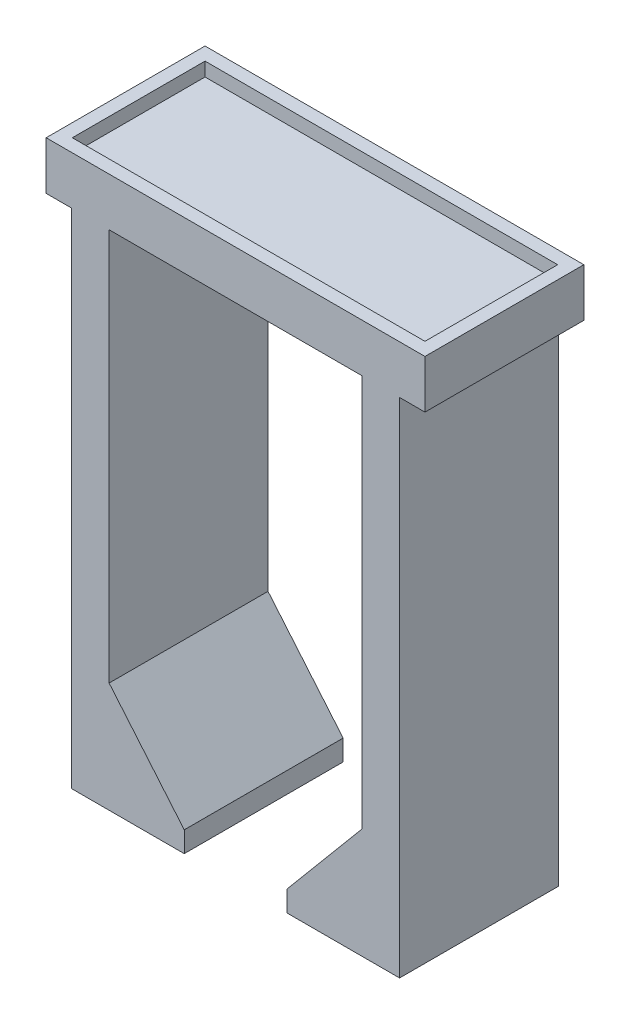
ISO-10303-21;
HEADER;
FILE_DESCRIPTION(('STEP AP214'),'2;1');
FILE_NAME('part.step','',(''),(''),'','','');
FILE_SCHEMA(('AUTOMOTIVE_DESIGN { 1 0 10303 214 1 1 1 1 }'));
ENDSEC;
DATA;
#1=APPLICATION_CONTEXT('core data for automotive mechanical design processes');
#2=APPLICATION_PROTOCOL_DEFINITION('international standard','automotive_design',2000,#1);
#3=PRODUCT_CONTEXT('',#1,'mechanical');
#4=PRODUCT('Part','Part','',(#3));
#5=PRODUCT_RELATED_PRODUCT_CATEGORY('part','',(#4));
#6=PRODUCT_DEFINITION_FORMATION('','',#4);
#7=PRODUCT_DEFINITION_CONTEXT('part definition',#1,'design');
#8=PRODUCT_DEFINITION('design','',#6,#7);
#9=PRODUCT_DEFINITION_SHAPE('','',#8);
#10=(LENGTH_UNIT() NAMED_UNIT(*) SI_UNIT(.MILLI.,.METRE.));
#11=(NAMED_UNIT(*) PLANE_ANGLE_UNIT() SI_UNIT($,.RADIAN.));
#12=(NAMED_UNIT(*) SI_UNIT($,.STERADIAN.) SOLID_ANGLE_UNIT());
#13=UNCERTAINTY_MEASURE_WITH_UNIT(LENGTH_MEASURE(1.E-05),#10,'distance_accuracy_value','');
#14=(GEOMETRIC_REPRESENTATION_CONTEXT(3) GLOBAL_UNCERTAINTY_ASSIGNED_CONTEXT((#13)) GLOBAL_UNIT_ASSIGNED_CONTEXT((#10,
#11,#12)) REPRESENTATION_CONTEXT('',''));
#15=CARTESIAN_POINT('',(0.,0.,0.));
#16=DIRECTION('',(0.,0.,1.));
#17=DIRECTION('',(1.,0.,0.));
#18=AXIS2_PLACEMENT_3D('',#15,#16,#17);
#19=CARTESIAN_POINT('',(0.,25.,0.));
#20=DIRECTION('',(0.,1.,0.));
#21=DIRECTION('',(0.,0.,1.));
#22=AXIS2_PLACEMENT_3D('',#19,#20,#21);
#23=PLANE('',#22);
#24=DIRECTION('',(-1.,0.,0.));
#25=VECTOR('',#24,1.);
#26=CARTESIAN_POINT('',(27.4999999999999,25.,-11.5350000000002));
#27=LINE('',#26,#25);
#28=CARTESIAN_POINT('',(-23.8159981116584,25.,-11.5349999999996));
#29=VERTEX_POINT('',#28);
#30=CARTESIAN_POINT('',(-27.5000000000001,25.,-11.5349999999998));
#31=VERTEX_POINT('',#30);
#32=EDGE_CURVE('E321',#29,#31,#27,.T.);
#33=ORIENTED_EDGE('',*,*,#32,.F.);
#34=DIRECTION('',(0.,0.,1.));
#35=VECTOR('',#34,1.);
#36=CARTESIAN_POINT('',(-23.815998111658,25.,11.5350000000002));
#37=LINE('',#36,#35);
#38=CARTESIAN_POINT('',(-23.815998111658,25.,11.5350000000002));
#39=VERTEX_POINT('',#38);
#40=EDGE_CURVE('E189',#29,#39,#37,.T.);
#41=ORIENTED_EDGE('',*,*,#40,.T.);
#42=DIRECTION('',(1.,0.,0.));
#43=VECTOR('',#42,1.);
#44=CARTESIAN_POINT('',(-27.4999999999999,25.,11.5350000000002));
#45=LINE('',#44,#43);
#46=CARTESIAN_POINT('',(-27.4999999999999,25.,11.5350000000002));
#47=VERTEX_POINT('',#46);
#48=EDGE_CURVE('E325',#47,#39,#45,.T.);
#49=ORIENTED_EDGE('',*,*,#48,.F.);
#50=DIRECTION('',(0.,0.,1.));
#51=VECTOR('',#50,1.);
#52=CARTESIAN_POINT('',(-27.5000000000001,25.,-11.5349999999998));
#53=LINE('',#52,#51);
#54=EDGE_CURVE('E315',#31,#47,#53,.T.);
#55=ORIENTED_EDGE('',*,*,#54,.F.);
#56=EDGE_LOOP('',(#33,#41,#49,#55));
#57=FACE_BOUND('',#56,.T.);
#58=ADVANCED_FACE('F35',(#57),#23,.F.);
#59=DIRECTION('',(0.,0.,1.));
#60=VECTOR('',#59,1.);
#61=CARTESIAN_POINT('',(23.8159981116582,25.,11.5349999999998));
#62=LINE('',#61,#60);
#63=CARTESIAN_POINT('',(23.8159981116582,25.,-11.5350000000002));
#64=VERTEX_POINT('',#63);
#65=CARTESIAN_POINT('',(23.8159981116582,25.,11.5349999999998));
#66=VERTEX_POINT('',#65);
#67=EDGE_CURVE('E254',#64,#66,#62,.T.);
#68=ORIENTED_EDGE('',*,*,#67,.F.);
#69=CARTESIAN_POINT('',(27.4999999999999,25.,-11.5350000000002));
#70=VERTEX_POINT('',#69);
#71=EDGE_CURVE('E316',#70,#64,#27,.T.);
#72=ORIENTED_EDGE('',*,*,#71,.F.);
#73=DIRECTION('',(0.,0.,-1.));
#74=VECTOR('',#73,1.);
#75=CARTESIAN_POINT('',(27.5000000000001,25.,11.5349999999998));
#76=LINE('',#75,#74);
#77=CARTESIAN_POINT('',(27.5000000000001,25.,11.5349999999998));
#78=VERTEX_POINT('',#77);
#79=EDGE_CURVE('E312',#78,#70,#76,.T.);
#80=ORIENTED_EDGE('',*,*,#79,.F.);
#81=EDGE_CURVE('E319',#66,#78,#45,.T.);
#82=ORIENTED_EDGE('',*,*,#81,.F.);
#83=EDGE_LOOP('',(#68,#72,#80,#82));
#84=FACE_BOUND('',#83,.T.);
#85=ADVANCED_FACE('F380',(#84),#23,.F.);
#86=CARTESIAN_POINT('',(-18.3582173931283,25.,11.5350000000001));
#87=VERTEX_POINT('',#86);
#88=CARTESIAN_POINT('',(18.3582173931285,25.,11.5349999999998));
#89=VERTEX_POINT('',#88);
#90=EDGE_CURVE('E329',#87,#89,#45,.T.);
#91=ORIENTED_EDGE('',*,*,#90,.F.);
#92=DIRECTION('',(0.,0.,-1.));
#93=VECTOR('',#92,1.);
#94=CARTESIAN_POINT('',(-18.3582173931287,25.,-11.5349999999999));
#95=LINE('',#94,#93);
#96=CARTESIAN_POINT('',(-18.3582173931287,25.,-11.5349999999999));
#97=VERTEX_POINT('',#96);
#98=EDGE_CURVE('E224',#87,#97,#95,.T.);
#99=ORIENTED_EDGE('',*,*,#98,.T.);
#100=CARTESIAN_POINT('',(18.3582173931285,25.,-11.5350000000002));
#101=VERTEX_POINT('',#100);
#102=EDGE_CURVE('E320',#101,#97,#27,.T.);
#103=ORIENTED_EDGE('',*,*,#102,.F.);
#104=DIRECTION('',(0.,0.,-1.));
#105=VECTOR('',#104,1.);
#106=CARTESIAN_POINT('',(18.3582173931285,25.,-11.5350000000002));
#107=LINE('',#106,#105);
#108=EDGE_CURVE('E257',#89,#101,#107,.T.);
#109=ORIENTED_EDGE('',*,*,#108,.F.);
#110=EDGE_LOOP('',(#91,#99,#103,#109));
#111=FACE_BOUND('',#110,.T.);
#112=ADVANCED_FACE('F407',(#111),#23,.F.);
#113=CARTESIAN_POINT('',(27.5000000000001,30.,11.5349999999998));
#114=DIRECTION('',(-1.,0.,0.));
#115=DIRECTION('',(0.,0.,1.));
#116=AXIS2_PLACEMENT_3D('',#113,#114,#115);
#117=PLANE('',#116);
#118=ORIENTED_EDGE('',*,*,#79,.T.);
#119=DIRECTION('',(0.,-1.,0.));
#120=VECTOR('',#119,1.);
#121=CARTESIAN_POINT('',(27.4999999999999,30.,-11.5350000000002));
#122=LINE('',#121,#120);
#123=CARTESIAN_POINT('',(27.4999999999999,32.,-11.5350000000002));
#124=VERTEX_POINT('',#123);
#125=EDGE_CURVE('E338',#124,#70,#122,.T.);
#126=ORIENTED_EDGE('',*,*,#125,.F.);
#127=DIRECTION('',(0.,0.,-1.));
#128=VECTOR('',#127,1.);
#129=CARTESIAN_POINT('',(27.5,32.,-2.27461574114861E-13));
#130=LINE('',#129,#128);
#131=CARTESIAN_POINT('',(27.5000000000001,32.,11.5349999999998));
#132=VERTEX_POINT('',#131);
#133=EDGE_CURVE('E275',#132,#124,#130,.T.);
#134=ORIENTED_EDGE('',*,*,#133,.F.);
#135=DIRECTION('',(0.,-1.,0.));
#136=VECTOR('',#135,1.);
#137=CARTESIAN_POINT('',(27.5000000000001,30.,11.5349999999998));
#138=LINE('',#137,#136);
#139=EDGE_CURVE('E324',#132,#78,#138,.T.);
#140=ORIENTED_EDGE('',*,*,#139,.T.);
#141=EDGE_LOOP('',(#118,#126,#134,#140));
#142=FACE_BOUND('',#141,.T.);
#143=ADVANCED_FACE('F378',(#142),#117,.F.);
#144=CARTESIAN_POINT('',(27.4999999999999,30.,-11.5350000000002));
#145=DIRECTION('',(0.,0.,1.));
#146=DIRECTION('',(1.,0.,0.));
#147=AXIS2_PLACEMENT_3D('',#144,#145,#146);
#148=PLANE('',#147);
#149=ORIENTED_EDGE('',*,*,#125,.T.);
#150=ORIENTED_EDGE('',*,*,#71,.T.);
#151=DIRECTION('',(0.,1.,0.));
#152=VECTOR('',#151,1.);
#153=CARTESIAN_POINT('',(23.8159981116582,-45.,-11.535));
#154=LINE('',#153,#152);
#155=CARTESIAN_POINT('',(23.8159981116582,-48.,-11.5350000000002));
#156=VERTEX_POINT('',#155);
#157=EDGE_CURVE('E260',#156,#64,#154,.T.);
#158=ORIENTED_EDGE('',*,*,#157,.F.);
#159=DIRECTION('',(1.,0.,0.));
#160=VECTOR('',#159,1.);
#161=CARTESIAN_POINT('',(23.8159981116582,-48.,-11.5350000000002));
#162=LINE('',#161,#160);
#163=CARTESIAN_POINT('',(7.44747380165818,-48.,-11.5350000000002));
#164=VERTEX_POINT('',#163);
#165=EDGE_CURVE('E240',#164,#156,#162,.T.);
#166=ORIENTED_EDGE('',*,*,#165,.F.);
#167=DIRECTION('',(0.,1.,0.));
#168=VECTOR('',#167,1.);
#169=CARTESIAN_POINT('',(7.44747380165818,-48.,-11.5350000000002));
#170=LINE('',#169,#168);
#171=CARTESIAN_POINT('',(7.44747380165818,-45.,-11.5350000000002));
#172=VERTEX_POINT('',#171);
#173=EDGE_CURVE('E243',#164,#172,#170,.T.);
#174=ORIENTED_EDGE('',*,*,#173,.T.);
#175=DIRECTION('',(1.,0.,0.));
#176=VECTOR('',#175,1.);
#177=CARTESIAN_POINT('',(23.8159981116582,-45.,-11.5350000000002));
#178=LINE('',#177,#176);
#179=CARTESIAN_POINT('',(7.44992218782377,-45.,-11.5350000000002));
#180=VERTEX_POINT('',#179);
#181=EDGE_CURVE('E236',#172,#180,#178,.T.);
#182=ORIENTED_EDGE('',*,*,#181,.T.);
#183=DIRECTION('',(0.642787609686543,0.766044443118975,0.));
#184=VECTOR('',#183,1.);
#185=CARTESIAN_POINT('',(52.6644220947875,8.88454270147408,-11.5350000000004));
#186=LINE('',#185,#184);
#187=CARTESIAN_POINT('',(18.3582173931285,-32.,-11.5350000000002));
#188=VERTEX_POINT('',#187);
#189=EDGE_CURVE('E344',#180,#188,#186,.T.);
#190=ORIENTED_EDGE('',*,*,#189,.T.);
#191=DIRECTION('',(0.,1.,0.));
#192=VECTOR('',#191,1.);
#193=CARTESIAN_POINT('',(18.3582173931285,-45.,-11.5350000000002));
#194=LINE('',#193,#192);
#195=EDGE_CURVE('E263',#188,#101,#194,.T.);
#196=ORIENTED_EDGE('',*,*,#195,.T.);
#197=ORIENTED_EDGE('',*,*,#102,.T.);
#198=DIRECTION('',(0.,1.,0.));
#199=VECTOR('',#198,1.);
#200=CARTESIAN_POINT('',(-18.3582173931287,-45.,-11.5349999999999));
#201=LINE('',#200,#199);
#202=CARTESIAN_POINT('',(-18.3582173931287,-32.0000000000001,-11.5349999999999));
#203=VERTEX_POINT('',#202);
#204=EDGE_CURVE('E193',#203,#97,#201,.T.);
#205=ORIENTED_EDGE('',*,*,#204,.F.);
#206=DIRECTION('',(-0.642787609686543,0.766044443118975,0.));
#207=VECTOR('',#206,1.);
#208=CARTESIAN_POINT('',(-29.939746980628,-18.1976705063617,-11.5349999999997));
#209=LINE('',#208,#207);
#210=CARTESIAN_POINT('',(-7.44992218782397,-45.,-11.5350000000001));
#211=VERTEX_POINT('',#210);
#212=EDGE_CURVE('E43',#203,#211,#209,.F.);
#213=ORIENTED_EDGE('',*,*,#212,.T.);
#214=DIRECTION('',(-1.,0.,0.));
#215=VECTOR('',#214,1.);
#216=CARTESIAN_POINT('',(-23.8159981116584,-45.,-11.5349999999998));
#217=LINE('',#216,#215);
#218=CARTESIAN_POINT('',(-7.44747380165837,-45.,-11.5350000000001));
#219=VERTEX_POINT('',#218);
#220=EDGE_CURVE('E214',#219,#211,#217,.T.);
#221=ORIENTED_EDGE('',*,*,#220,.F.);
#222=DIRECTION('',(0.,1.,0.));
#223=VECTOR('',#222,1.);
#224=CARTESIAN_POINT('',(-7.44747380165837,-48.,-11.5350000000001));
#225=LINE('',#224,#223);
#226=CARTESIAN_POINT('',(-7.44747380165837,-48.,-11.5350000000001));
#227=VERTEX_POINT('',#226);
#228=EDGE_CURVE('E207',#227,#219,#225,.T.);
#229=ORIENTED_EDGE('',*,*,#228,.F.);
#230=DIRECTION('',(-1.,0.,0.));
#231=VECTOR('',#230,1.);
#232=CARTESIAN_POINT('',(-23.8159981116584,-48.,-11.5349999999998));
#233=LINE('',#232,#231);
#234=CARTESIAN_POINT('',(-23.8159981116584,-48.,-11.5349999999998));
#235=VERTEX_POINT('',#234);
#236=EDGE_CURVE('E199',#227,#235,#233,.T.);
#237=ORIENTED_EDGE('',*,*,#236,.T.);
#238=DIRECTION('',(0.,1.,0.));
#239=VECTOR('',#238,1.);
#240=CARTESIAN_POINT('',(-23.8159981116584,-45.,-11.5349999999996));
#241=LINE('',#240,#239);
#242=EDGE_CURVE('E183',#235,#29,#241,.T.);
#243=ORIENTED_EDGE('',*,*,#242,.T.);
#244=ORIENTED_EDGE('',*,*,#32,.T.);
#245=DIRECTION('',(0.,-1.,0.));
#246=VECTOR('',#245,1.);
#247=CARTESIAN_POINT('',(-27.5000000000001,30.,-11.5349999999998));
#248=LINE('',#247,#246);
#249=CARTESIAN_POINT('',(-27.5000000000001,32.,-11.5349999999998));
#250=VERTEX_POINT('',#249);
#251=EDGE_CURVE('E335',#250,#31,#248,.T.);
#252=ORIENTED_EDGE('',*,*,#251,.F.);
#253=DIRECTION('',(-1.,0.,0.));
#254=VECTOR('',#253,1.);
#255=CARTESIAN_POINT('',(0.,32.,-11.535));
#256=LINE('',#255,#254);
#257=EDGE_CURVE('E279',#124,#250,#256,.T.);
#258=ORIENTED_EDGE('',*,*,#257,.F.);
#259=EDGE_LOOP('',(#149,#150,#158,#166,#174,#182,#190,#196,#197,#205,#213,#221,#229,#237,#243,
#244,#252,#258));
#260=FACE_BOUND('',#259,.T.);
#261=ADVANCED_FACE('F206',(#260),#148,.F.);
#262=CARTESIAN_POINT('',(-27.5000000000001,30.,-11.5349999999998));
#263=DIRECTION('',(1.,0.,0.));
#264=DIRECTION('',(0.,0.,-1.));
#265=AXIS2_PLACEMENT_3D('',#262,#263,#264);
#266=PLANE('',#265);
#267=ORIENTED_EDGE('',*,*,#54,.T.);
#268=DIRECTION('',(0.,-1.,0.));
#269=VECTOR('',#268,1.);
#270=CARTESIAN_POINT('',(-27.4999999999999,30.,11.5350000000002));
#271=LINE('',#270,#269);
#272=CARTESIAN_POINT('',(-27.4999999999999,32.,11.5350000000002));
#273=VERTEX_POINT('',#272);
#274=EDGE_CURVE('E332',#273,#47,#271,.T.);
#275=ORIENTED_EDGE('',*,*,#274,.F.);
#276=DIRECTION('',(0.,0.,1.));
#277=VECTOR('',#276,1.);
#278=CARTESIAN_POINT('',(-27.5,32.,2.27461574114861E-13));
#279=LINE('',#278,#277);
#280=EDGE_CURVE('E282',#250,#273,#279,.T.);
#281=ORIENTED_EDGE('',*,*,#280,.F.);
#282=ORIENTED_EDGE('',*,*,#251,.T.);
#283=EDGE_LOOP('',(#267,#275,#281,#282));
#284=FACE_BOUND('',#283,.T.);
#285=ADVANCED_FACE('F368',(#284),#266,.F.);
#286=CARTESIAN_POINT('',(-27.4999999999999,30.,11.5350000000002));
#287=DIRECTION('',(0.,0.,-1.));
#288=DIRECTION('',(-1.,0.,0.));
#289=AXIS2_PLACEMENT_3D('',#286,#287,#288);
#290=PLANE('',#289);
#291=ORIENTED_EDGE('',*,*,#274,.T.);
#292=ORIENTED_EDGE('',*,*,#48,.T.);
#293=DIRECTION('',(0.,1.,0.));
#294=VECTOR('',#293,1.);
#295=CARTESIAN_POINT('',(-23.815998111658,-45.,11.5350000000002));
#296=LINE('',#295,#294);
#297=CARTESIAN_POINT('',(-23.815998111658,-48.,11.5350000000002));
#298=VERTEX_POINT('',#297);
#299=EDGE_CURVE('E227',#298,#39,#296,.T.);
#300=ORIENTED_EDGE('',*,*,#299,.F.);
#301=DIRECTION('',(1.,0.,0.));
#302=VECTOR('',#301,1.);
#303=CARTESIAN_POINT('',(-7.44747380165799,-48.,11.5349999999999));
#304=LINE('',#303,#302);
#305=CARTESIAN_POINT('',(-7.44747380165799,-48.,11.5349999999999));
#306=VERTEX_POINT('',#305);
#307=EDGE_CURVE('E202',#298,#306,#304,.T.);
#308=ORIENTED_EDGE('',*,*,#307,.T.);
#309=DIRECTION('',(0.,1.,0.));
#310=VECTOR('',#309,1.);
#311=CARTESIAN_POINT('',(-7.44747380165799,-48.,11.5349999999999));
#312=LINE('',#311,#310);
#313=CARTESIAN_POINT('',(-7.44747380165799,-45.,11.5349999999999));
#314=VERTEX_POINT('',#313);
#315=EDGE_CURVE('E213',#306,#314,#312,.T.);
#316=ORIENTED_EDGE('',*,*,#315,.T.);
#317=DIRECTION('',(1.,0.,0.));
#318=VECTOR('',#317,1.);
#319=CARTESIAN_POINT('',(-7.44747380165799,-45.,11.5349999999999));
#320=LINE('',#319,#318);
#321=CARTESIAN_POINT('',(-7.44992218782359,-45.,11.5349999999999));
#322=VERTEX_POINT('',#321);
#323=EDGE_CURVE('E203',#322,#314,#320,.T.);
#324=ORIENTED_EDGE('',*,*,#323,.F.);
#325=DIRECTION('',(0.642787609686543,-0.766044443118975,0.));
#326=VECTOR('',#325,1.);
#327=CARTESIAN_POINT('',(-52.6644220947874,8.88454270147418,11.5350000000004));
#328=LINE('',#327,#326);
#329=CARTESIAN_POINT('',(-18.3582173931283,-32.0000000000001,11.5350000000005));
#330=VERTEX_POINT('',#329);
#331=EDGE_CURVE('E11',#322,#330,#328,.F.);
#332=ORIENTED_EDGE('',*,*,#331,.T.);
#333=DIRECTION('',(0.,1.,0.));
#334=VECTOR('',#333,1.);
#335=CARTESIAN_POINT('',(-18.3582173931283,-45.,11.5350000000005));
#336=LINE('',#335,#334);
#337=EDGE_CURVE('E229',#330,#87,#336,.T.);
#338=ORIENTED_EDGE('',*,*,#337,.T.);
#339=ORIENTED_EDGE('',*,*,#90,.T.);
#340=DIRECTION('',(0.,1.,0.));
#341=VECTOR('',#340,1.);
#342=CARTESIAN_POINT('',(18.3582173931285,-45.,11.5350000000002));
#343=LINE('',#342,#341);
#344=CARTESIAN_POINT('',(18.3582173931285,-32.,11.5350000000002));
#345=VERTEX_POINT('',#344);
#346=EDGE_CURVE('E265',#345,#89,#343,.T.);
#347=ORIENTED_EDGE('',*,*,#346,.F.);
#348=DIRECTION('',(-0.642787609686543,-0.766044443118975,0.));
#349=VECTOR('',#348,1.);
#350=CARTESIAN_POINT('',(29.9397469806279,-18.1976705063616,11.5349999999997));
#351=LINE('',#350,#349);
#352=CARTESIAN_POINT('',(7.44992218782376,-45.,11.5349999999998));
#353=VERTEX_POINT('',#352);
#354=EDGE_CURVE('E346',#345,#353,#351,.T.);
#355=ORIENTED_EDGE('',*,*,#354,.T.);
#356=DIRECTION('',(-1.,0.,0.));
#357=VECTOR('',#356,1.);
#358=CARTESIAN_POINT('',(7.44747380165818,-45.,11.5349999999998));
#359=LINE('',#358,#357);
#360=CARTESIAN_POINT('',(7.44747380165818,-45.,11.5349999999998));
#361=VERTEX_POINT('',#360);
#362=EDGE_CURVE('E192',#353,#361,#359,.T.);
#363=ORIENTED_EDGE('',*,*,#362,.T.);
#364=DIRECTION('',(0.,1.,0.));
#365=VECTOR('',#364,1.);
#366=CARTESIAN_POINT('',(7.44747380165818,-48.,11.5349999999998));
#367=LINE('',#366,#365);
#368=CARTESIAN_POINT('',(7.44747380165818,-48.,11.5349999999998));
#369=VERTEX_POINT('',#368);
#370=EDGE_CURVE('E251',#369,#361,#367,.T.);
#371=ORIENTED_EDGE('',*,*,#370,.F.);
#372=DIRECTION('',(-1.,0.,0.));
#373=VECTOR('',#372,1.);
#374=CARTESIAN_POINT('',(7.44747380165818,-48.,11.5349999999998));
#375=LINE('',#374,#373);
#376=CARTESIAN_POINT('',(23.8159981116582,-48.,11.5349999999998));
#377=VERTEX_POINT('',#376);
#378=EDGE_CURVE('E235',#377,#369,#375,.T.);
#379=ORIENTED_EDGE('',*,*,#378,.F.);
#380=DIRECTION('',(0.,1.,0.));
#381=VECTOR('',#380,1.);
#382=CARTESIAN_POINT('',(23.8159981116582,-45.,11.5349999999998));
#383=LINE('',#382,#381);
#384=EDGE_CURVE('E268',#377,#66,#383,.T.);
#385=ORIENTED_EDGE('',*,*,#384,.T.);
#386=ORIENTED_EDGE('',*,*,#81,.T.);
#387=ORIENTED_EDGE('',*,*,#139,.F.);
#388=DIRECTION('',(1.,0.,0.));
#389=VECTOR('',#388,1.);
#390=CARTESIAN_POINT('',(0.,32.,11.535));
#391=LINE('',#390,#389);
#392=EDGE_CURVE('E272',#273,#132,#391,.T.);
#393=ORIENTED_EDGE('',*,*,#392,.F.);
#394=EDGE_LOOP('',(#291,#292,#300,#308,#316,#324,#332,#338,#339,#347,#355,#363,#371,#379,#385,
#386,#387,#393));
#395=FACE_BOUND('',#394,.T.);
#396=ADVANCED_FACE('F370',(#395),#290,.F.);
#397=CARTESIAN_POINT('',(25.6000000000001,32.,0.));
#398=DIRECTION('',(1.,0.,0.));
#399=DIRECTION('',(0.,0.,-1.));
#400=AXIS2_PLACEMENT_3D('',#397,#398,#399);
#401=PLANE('',#400);
#402=DIRECTION('',(0.,0.,1.));
#403=VECTOR('',#402,1.);
#404=CARTESIAN_POINT('',(25.6000000000001,30.,0.));
#405=LINE('',#404,#403);
#406=CARTESIAN_POINT('',(25.6000000000001,30.,-9.63500000000022));
#407=VERTEX_POINT('',#406);
#408=CARTESIAN_POINT('',(25.6000000000001,30.,9.63499999999977));
#409=VERTEX_POINT('',#408);
#410=EDGE_CURVE('E271',#407,#409,#405,.T.);
#411=ORIENTED_EDGE('',*,*,#410,.T.);
#412=DIRECTION('',(0.,-1.,0.));
#413=VECTOR('',#412,1.);
#414=CARTESIAN_POINT('',(25.6000000000001,32.,9.63499999999977));
#415=LINE('',#414,#413);
#416=CARTESIAN_POINT('',(25.6000000000001,32.,9.63499999999977));
#417=VERTEX_POINT('',#416);
#418=EDGE_CURVE('E310',#417,#409,#415,.T.);
#419=ORIENTED_EDGE('',*,*,#418,.F.);
#420=DIRECTION('',(0.,0.,1.));
#421=VECTOR('',#420,1.);
#422=CARTESIAN_POINT('',(25.6000000000001,32.,0.));
#423=LINE('',#422,#421);
#424=CARTESIAN_POINT('',(25.6000000000001,32.,-9.63500000000022));
#425=VERTEX_POINT('',#424);
#426=EDGE_CURVE('E285',#425,#417,#423,.T.);
#427=ORIENTED_EDGE('',*,*,#426,.F.);
#428=DIRECTION('',(0.,-1.,0.));
#429=VECTOR('',#428,1.);
#430=CARTESIAN_POINT('',(25.6000000000001,32.,-9.63500000000022));
#431=LINE('',#430,#429);
#432=EDGE_CURVE('E294',#425,#407,#431,.T.);
#433=ORIENTED_EDGE('',*,*,#432,.T.);
#434=EDGE_LOOP('',(#411,#419,#427,#433));
#435=FACE_BOUND('',#434,.T.);
#436=ADVANCED_FACE('F463',(#435),#401,.F.);
#437=CARTESIAN_POINT('',(0.,32.,9.63499999999978));
#438=DIRECTION('',(0.,0.,1.));
#439=DIRECTION('',(1.,0.,0.));
#440=AXIS2_PLACEMENT_3D('',#437,#438,#439);
#441=PLANE('',#440);
#442=DIRECTION('',(-1.,0.,0.));
#443=VECTOR('',#442,1.);
#444=CARTESIAN_POINT('',(0.,30.,9.63499999999978));
#445=LINE('',#444,#443);
#446=CARTESIAN_POINT('',(-25.6000000000001,30.,9.63499999999978));
#447=VERTEX_POINT('',#446);
#448=EDGE_CURVE('E297',#409,#447,#445,.T.);
#449=ORIENTED_EDGE('',*,*,#448,.T.);
#450=DIRECTION('',(0.,-1.,0.));
#451=VECTOR('',#450,1.);
#452=CARTESIAN_POINT('',(-25.6000000000001,32.,9.63499999999978));
#453=LINE('',#452,#451);
#454=CARTESIAN_POINT('',(-25.6000000000001,32.,9.63499999999978));
#455=VERTEX_POINT('',#454);
#456=EDGE_CURVE('E307',#455,#447,#453,.T.);
#457=ORIENTED_EDGE('',*,*,#456,.F.);
#458=DIRECTION('',(-1.,0.,0.));
#459=VECTOR('',#458,1.);
#460=CARTESIAN_POINT('',(0.,32.,9.63499999999978));
#461=LINE('',#460,#459);
#462=EDGE_CURVE('E288',#417,#455,#461,.T.);
#463=ORIENTED_EDGE('',*,*,#462,.F.);
#464=ORIENTED_EDGE('',*,*,#418,.T.);
#465=EDGE_LOOP('',(#449,#457,#463,#464));
#466=FACE_BOUND('',#465,.T.);
#467=ADVANCED_FACE('F459',(#466),#441,.F.);
#468=CARTESIAN_POINT('',(-25.6000000000001,32.,0.));
#469=DIRECTION('',(-1.,0.,0.));
#470=DIRECTION('',(0.,0.,1.));
#471=AXIS2_PLACEMENT_3D('',#468,#469,#470);
#472=PLANE('',#471);
#473=DIRECTION('',(0.,0.,-1.));
#474=VECTOR('',#473,1.);
#475=CARTESIAN_POINT('',(-25.6000000000001,30.,0.));
#476=LINE('',#475,#474);
#477=CARTESIAN_POINT('',(-25.6000000000001,30.,-9.63500000000022));
#478=VERTEX_POINT('',#477);
#479=EDGE_CURVE('E299',#447,#478,#476,.T.);
#480=ORIENTED_EDGE('',*,*,#479,.T.);
#481=DIRECTION('',(0.,-1.,0.));
#482=VECTOR('',#481,1.);
#483=CARTESIAN_POINT('',(-25.6000000000001,32.,-9.63500000000022));
#484=LINE('',#483,#482);
#485=CARTESIAN_POINT('',(-25.6000000000001,32.,-9.63500000000022));
#486=VERTEX_POINT('',#485);
#487=EDGE_CURVE('E305',#486,#478,#484,.T.);
#488=ORIENTED_EDGE('',*,*,#487,.F.);
#489=DIRECTION('',(0.,0.,-1.));
#490=VECTOR('',#489,1.);
#491=CARTESIAN_POINT('',(-25.6000000000001,32.,0.));
#492=LINE('',#491,#490);
#493=EDGE_CURVE('E290',#455,#486,#492,.T.);
#494=ORIENTED_EDGE('',*,*,#493,.F.);
#495=ORIENTED_EDGE('',*,*,#456,.T.);
#496=EDGE_LOOP('',(#480,#488,#494,#495));
#497=FACE_BOUND('',#496,.T.);
#498=ADVANCED_FACE('F455',(#497),#472,.F.);
#499=CARTESIAN_POINT('',(0.,32.,-9.63500000000022));
#500=DIRECTION('',(0.,0.,-1.));
#501=DIRECTION('',(-1.,0.,0.));
#502=AXIS2_PLACEMENT_3D('',#499,#500,#501);
#503=PLANE('',#502);
#504=DIRECTION('',(1.,0.,0.));
#505=VECTOR('',#504,1.);
#506=CARTESIAN_POINT('',(0.,30.,-9.63500000000022));
#507=LINE('',#506,#505);
#508=EDGE_CURVE('E276',#478,#407,#507,.T.);
#509=ORIENTED_EDGE('',*,*,#508,.T.);
#510=ORIENTED_EDGE('',*,*,#432,.F.);
#511=DIRECTION('',(1.,0.,0.));
#512=VECTOR('',#511,1.);
#513=CARTESIAN_POINT('',(0.,32.,-9.63500000000022));
#514=LINE('',#513,#512);
#515=EDGE_CURVE('E292',#486,#425,#514,.T.);
#516=ORIENTED_EDGE('',*,*,#515,.F.);
#517=ORIENTED_EDGE('',*,*,#487,.T.);
#518=EDGE_LOOP('',(#509,#510,#516,#517));
#519=FACE_BOUND('',#518,.T.);
#520=ADVANCED_FACE('F452',(#519),#503,.F.);
#521=CARTESIAN_POINT('',(0.,32.,0.));
#522=DIRECTION('',(0.,1.,0.));
#523=DIRECTION('',(0.,0.,1.));
#524=AXIS2_PLACEMENT_3D('',#521,#522,#523);
#525=PLANE('',#524);
#526=ORIENTED_EDGE('',*,*,#392,.T.);
#527=ORIENTED_EDGE('',*,*,#133,.T.);
#528=ORIENTED_EDGE('',*,*,#257,.T.);
#529=ORIENTED_EDGE('',*,*,#280,.T.);
#530=EDGE_LOOP('',(#526,#527,#528,#529));
#531=FACE_BOUND('',#530,.T.);
#532=ORIENTED_EDGE('',*,*,#426,.T.);
#533=ORIENTED_EDGE('',*,*,#462,.T.);
#534=ORIENTED_EDGE('',*,*,#493,.T.);
#535=ORIENTED_EDGE('',*,*,#515,.T.);
#536=EDGE_LOOP('',(#532,#533,#534,#535));
#537=FACE_BOUND('',#536,.T.);
#538=ADVANCED_FACE('F373',(#531,#537),#525,.T.);
#539=CARTESIAN_POINT('',(0.,30.,0.));
#540=DIRECTION('',(0.,1.,0.));
#541=DIRECTION('',(0.,0.,1.));
#542=AXIS2_PLACEMENT_3D('',#539,#540,#541);
#543=PLANE('',#542);
#544=ORIENTED_EDGE('',*,*,#448,.F.);
#545=ORIENTED_EDGE('',*,*,#410,.F.);
#546=ORIENTED_EDGE('',*,*,#508,.F.);
#547=ORIENTED_EDGE('',*,*,#479,.F.);
#548=EDGE_LOOP('',(#544,#545,#546,#547));
#549=FACE_BOUND('',#548,.T.);
#550=ADVANCED_FACE('F449',(#549),#543,.T.);
#551=CARTESIAN_POINT('',(23.8159981116582,-45.,11.5349999999998));
#552=DIRECTION('',(-1.,0.,0.));
#553=DIRECTION('',(0.,0.,1.));
#554=AXIS2_PLACEMENT_3D('',#551,#552,#553);
#555=PLANE('',#554);
#556=ORIENTED_EDGE('',*,*,#67,.T.);
#557=ORIENTED_EDGE('',*,*,#384,.F.);
#558=DIRECTION('',(0.,0.,1.));
#559=VECTOR('',#558,1.);
#560=CARTESIAN_POINT('',(23.8159981116582,-48.,-11.5350000000002));
#561=LINE('',#560,#559);
#562=EDGE_CURVE('E232',#156,#377,#561,.T.);
#563=ORIENTED_EDGE('',*,*,#562,.F.);
#564=ORIENTED_EDGE('',*,*,#157,.T.);
#565=EDGE_LOOP('',(#556,#557,#563,#564));
#566=FACE_BOUND('',#565,.T.);
#567=ADVANCED_FACE('F382',(#566),#555,.F.);
#568=CARTESIAN_POINT('',(18.3582173931285,-45.,-11.5350000000002));
#569=DIRECTION('',(1.,0.,0.));
#570=DIRECTION('',(0.,0.,-1.));
#571=AXIS2_PLACEMENT_3D('',#568,#569,#570);
#572=PLANE('',#571);
#573=ORIENTED_EDGE('',*,*,#195,.F.);
#574=DIRECTION('',(0.,0.,1.));
#575=VECTOR('',#574,1.);
#576=CARTESIAN_POINT('',(18.3582173931285,-32.,-11.5350000000002));
#577=LINE('',#576,#575);
#578=EDGE_CURVE('E342',#188,#345,#577,.T.);
#579=ORIENTED_EDGE('',*,*,#578,.T.);
#580=ORIENTED_EDGE('',*,*,#346,.T.);
#581=ORIENTED_EDGE('',*,*,#108,.T.);
#582=EDGE_LOOP('',(#573,#579,#580,#581));
#583=FACE_BOUND('',#582,.T.);
#584=ADVANCED_FACE('F404',(#583),#572,.F.);
#585=CARTESIAN_POINT('',(7.44747380165818,-48.,-11.5350000000002));
#586=DIRECTION('',(1.,0.,0.));
#587=DIRECTION('',(0.,0.,-1.));
#588=AXIS2_PLACEMENT_3D('',#585,#586,#587);
#589=PLANE('',#588);
#590=DIRECTION('',(0.,0.,-1.));
#591=VECTOR('',#590,1.);
#592=CARTESIAN_POINT('',(7.44747380165818,-45.,-11.5350000000002));
#593=LINE('',#592,#591);
#594=EDGE_CURVE('E245',#361,#172,#593,.T.);
#595=ORIENTED_EDGE('',*,*,#594,.T.);
#596=ORIENTED_EDGE('',*,*,#173,.F.);
#597=DIRECTION('',(0.,0.,-1.));
#598=VECTOR('',#597,1.);
#599=CARTESIAN_POINT('',(7.44747380165818,-48.,-11.5350000000002));
#600=LINE('',#599,#598);
#601=EDGE_CURVE('E238',#369,#164,#600,.T.);
#602=ORIENTED_EDGE('',*,*,#601,.F.);
#603=ORIENTED_EDGE('',*,*,#370,.T.);
#604=EDGE_LOOP('',(#595,#596,#602,#603));
#605=FACE_BOUND('',#604,.T.);
#606=ADVANCED_FACE('F392',(#605),#589,.F.);
#607=CARTESIAN_POINT('',(0.,-48.,0.));
#608=DIRECTION('',(0.,1.,0.));
#609=DIRECTION('',(0.,0.,1.));
#610=AXIS2_PLACEMENT_3D('',#607,#608,#609);
#611=PLANE('',#610);
#612=ORIENTED_EDGE('',*,*,#562,.T.);
#613=ORIENTED_EDGE('',*,*,#378,.T.);
#614=ORIENTED_EDGE('',*,*,#601,.T.);
#615=ORIENTED_EDGE('',*,*,#165,.T.);
#616=EDGE_LOOP('',(#612,#613,#614,#615));
#617=FACE_BOUND('',#616,.T.);
#618=ADVANCED_FACE('F387',(#617),#611,.F.);
#619=CARTESIAN_POINT('',(0.,-45.,0.));
#620=DIRECTION('',(0.,1.,0.));
#621=DIRECTION('',(0.,0.,1.));
#622=AXIS2_PLACEMENT_3D('',#619,#620,#621);
#623=PLANE('',#622);
#624=ORIENTED_EDGE('',*,*,#362,.F.);
#625=DIRECTION('',(0.,0.,-1.));
#626=VECTOR('',#625,1.);
#627=CARTESIAN_POINT('',(7.44992218782377,-45.,0.));
#628=LINE('',#627,#626);
#629=EDGE_CURVE('E328',#353,#180,#628,.T.);
#630=ORIENTED_EDGE('',*,*,#629,.T.);
#631=ORIENTED_EDGE('',*,*,#181,.F.);
#632=ORIENTED_EDGE('',*,*,#594,.F.);
#633=EDGE_LOOP('',(#624,#630,#631,#632));
#634=FACE_BOUND('',#633,.T.);
#635=ADVANCED_FACE('F397',(#634),#623,.T.);
#636=CARTESIAN_POINT('',(7.44992218782377,-45.,0.));
#637=DIRECTION('',(0.766044443118975,-0.642787609686543,0.));
#638=DIRECTION('',(0.,0.,-1.));
#639=AXIS2_PLACEMENT_3D('',#636,#637,#638);
#640=PLANE('',#639);
#641=ORIENTED_EDGE('',*,*,#354,.F.);
#642=ORIENTED_EDGE('',*,*,#578,.F.);
#643=ORIENTED_EDGE('',*,*,#189,.F.);
#644=ORIENTED_EDGE('',*,*,#629,.F.);
#645=EDGE_LOOP('',(#641,#642,#643,#644));
#646=FACE_BOUND('',#645,.T.);
#647=ADVANCED_FACE('F401',(#646),#640,.F.);
#648=CARTESIAN_POINT('',(-23.815998111658,-45.,11.5350000000002));
#649=DIRECTION('',(-1.,0.,0.));
#650=DIRECTION('',(0.,0.,1.));
#651=AXIS2_PLACEMENT_3D('',#648,#649,#650);
#652=PLANE('',#651);
#653=ORIENTED_EDGE('',*,*,#40,.F.);
#654=ORIENTED_EDGE('',*,*,#242,.F.);
#655=DIRECTION('',(0.,0.,1.));
#656=VECTOR('',#655,1.);
#657=CARTESIAN_POINT('',(-23.8159981116584,-48.,-11.5349999999998));
#658=LINE('',#657,#656);
#659=EDGE_CURVE('E186',#235,#298,#658,.T.);
#660=ORIENTED_EDGE('',*,*,#659,.T.);
#661=ORIENTED_EDGE('',*,*,#299,.T.);
#662=EDGE_LOOP('',(#653,#654,#660,#661));
#663=FACE_BOUND('',#662,.T.);
#664=ADVANCED_FACE('F185',(#663),#652,.T.);
#665=CARTESIAN_POINT('',(-18.3582173931287,-45.,-11.5349999999999));
#666=DIRECTION('',(1.,0.,0.));
#667=DIRECTION('',(0.,0.,-1.));
#668=AXIS2_PLACEMENT_3D('',#665,#666,#667);
#669=PLANE('',#668);
#670=ORIENTED_EDGE('',*,*,#337,.F.);
#671=DIRECTION('',(0.,0.,-1.));
#672=VECTOR('',#671,1.);
#673=CARTESIAN_POINT('',(-18.3582173931287,-32.0000000000001,-11.5349999999999));
#674=LINE('',#673,#672);
#675=EDGE_CURVE('E348',#330,#203,#674,.T.);
#676=ORIENTED_EDGE('',*,*,#675,.T.);
#677=ORIENTED_EDGE('',*,*,#204,.T.);
#678=ORIENTED_EDGE('',*,*,#98,.F.);
#679=EDGE_LOOP('',(#670,#676,#677,#678));
#680=FACE_BOUND('',#679,.T.);
#681=ADVANCED_FACE('F354',(#680),#669,.T.);
#682=CARTESIAN_POINT('',(-7.44747380165837,-48.,-11.5350000000001));
#683=DIRECTION('',(1.,0.,0.));
#684=DIRECTION('',(0.,0.,-1.));
#685=AXIS2_PLACEMENT_3D('',#682,#683,#684);
#686=PLANE('',#685);
#687=DIRECTION('',(0.,0.,-1.));
#688=VECTOR('',#687,1.);
#689=CARTESIAN_POINT('',(-7.44747380165837,-45.,-11.5350000000001));
#690=LINE('',#689,#688);
#691=EDGE_CURVE('E216',#314,#219,#690,.T.);
#692=ORIENTED_EDGE('',*,*,#691,.F.);
#693=ORIENTED_EDGE('',*,*,#315,.F.);
#694=DIRECTION('',(0.,0.,-1.));
#695=VECTOR('',#694,1.);
#696=CARTESIAN_POINT('',(-7.44747380165837,-48.,-11.5350000000001));
#697=LINE('',#696,#695);
#698=EDGE_CURVE('E208',#306,#227,#697,.T.);
#699=ORIENTED_EDGE('',*,*,#698,.T.);
#700=ORIENTED_EDGE('',*,*,#228,.T.);
#701=EDGE_LOOP('',(#692,#693,#699,#700));
#702=FACE_BOUND('',#701,.T.);
#703=ADVANCED_FACE('F558',(#702),#686,.T.);
#704=CARTESIAN_POINT('',(0.,-48.,0.));
#705=DIRECTION('',(0.,1.,0.));
#706=DIRECTION('',(0.,0.,1.));
#707=AXIS2_PLACEMENT_3D('',#704,#705,#706);
#708=PLANE('',#707);
#709=ORIENTED_EDGE('',*,*,#659,.F.);
#710=ORIENTED_EDGE('',*,*,#236,.F.);
#711=ORIENTED_EDGE('',*,*,#698,.F.);
#712=ORIENTED_EDGE('',*,*,#307,.F.);
#713=EDGE_LOOP('',(#709,#710,#711,#712));
#714=FACE_BOUND('',#713,.T.);
#715=ADVANCED_FACE('F197',(#714),#708,.F.);
#716=CARTESIAN_POINT('',(0.,-45.,0.));
#717=DIRECTION('',(0.,1.,0.));
#718=DIRECTION('',(0.,0.,1.));
#719=AXIS2_PLACEMENT_3D('',#716,#717,#718);
#720=PLANE('',#719);
#721=ORIENTED_EDGE('',*,*,#220,.T.);
#722=DIRECTION('',(0.,0.,1.));
#723=VECTOR('',#722,1.);
#724=CARTESIAN_POINT('',(-7.44992218782359,-45.,11.5350000000003));
#725=LINE('',#724,#723);
#726=EDGE_CURVE('E50',#211,#322,#725,.T.);
#727=ORIENTED_EDGE('',*,*,#726,.T.);
#728=ORIENTED_EDGE('',*,*,#323,.T.);
#729=ORIENTED_EDGE('',*,*,#691,.T.);
#730=EDGE_LOOP('',(#721,#727,#728,#729));
#731=FACE_BOUND('',#730,.T.);
#732=ADVANCED_FACE('F409',(#731),#720,.T.);
#733=CARTESIAN_POINT('',(-18.3582173931287,-32.0000000000001,-11.5349999999999));
#734=DIRECTION('',(0.766044443118975,0.642787609686543,0.));
#735=DIRECTION('',(0.,0.,1.));
#736=AXIS2_PLACEMENT_3D('',#733,#734,#735);
#737=PLANE('',#736);
#738=ORIENTED_EDGE('',*,*,#331,.F.);
#739=ORIENTED_EDGE('',*,*,#726,.F.);
#740=ORIENTED_EDGE('',*,*,#212,.F.);
#741=ORIENTED_EDGE('',*,*,#675,.F.);
#742=EDGE_LOOP('',(#738,#739,#740,#741));
#743=FACE_BOUND('',#742,.T.);
#744=ADVANCED_FACE('F37',(#743),#737,.T.);
#745=CLOSED_SHELL('',(#58,#85,#112,#143,#261,#285,#396,#436,#467,#498,#520,#538,#550,#567,#584,
#606,#618,#635,#647,#664,#681,#703,#715,#732,#744));
#746=MANIFOLD_SOLID_BREP('B2',#745);
#747=ADVANCED_BREP_SHAPE_REPRESENTATION('',(#18,#746),#14);
#748=SHAPE_DEFINITION_REPRESENTATION(#9,#747);
ENDSEC;
END-ISO-10303-21;
